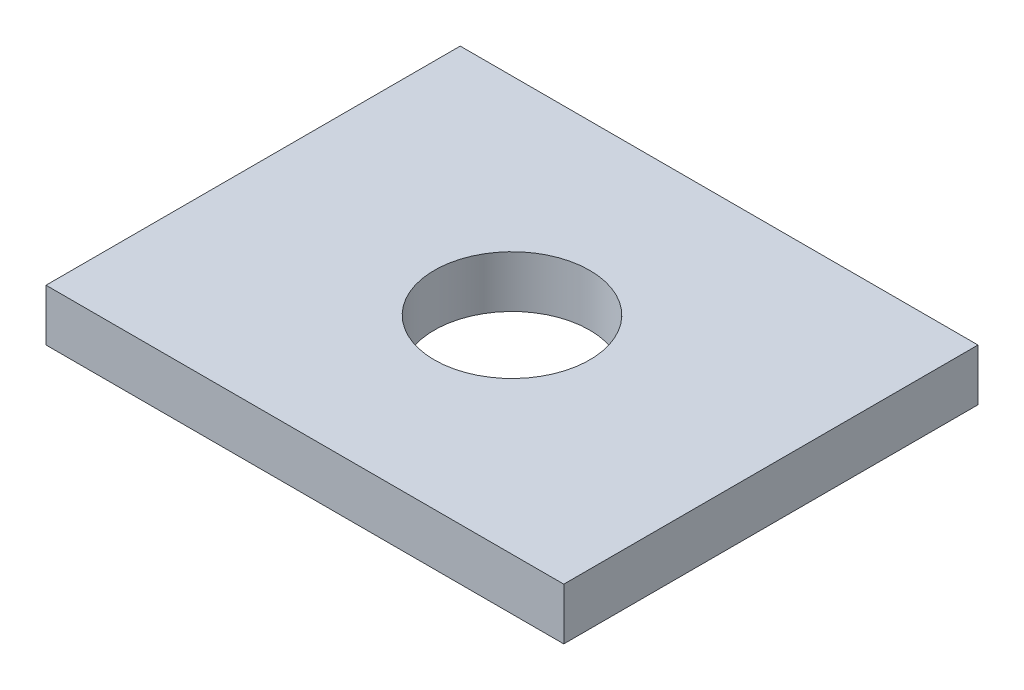
ISO-10303-21;
HEADER;
FILE_DESCRIPTION(('STEP AP214'),'2;1');
FILE_NAME('part.step','',(''),(''),'','','');
FILE_SCHEMA(('AUTOMOTIVE_DESIGN { 1 0 10303 214 1 1 1 1 }'));
ENDSEC;
DATA;
#1=APPLICATION_CONTEXT('core data for automotive mechanical design processes');
#2=APPLICATION_PROTOCOL_DEFINITION('international standard','automotive_design',2000,#1);
#3=PRODUCT_CONTEXT('',#1,'mechanical');
#4=PRODUCT('Part','Part','',(#3));
#5=PRODUCT_RELATED_PRODUCT_CATEGORY('part','',(#4));
#6=PRODUCT_DEFINITION_FORMATION('','',#4);
#7=PRODUCT_DEFINITION_CONTEXT('part definition',#1,'design');
#8=PRODUCT_DEFINITION('design','',#6,#7);
#9=PRODUCT_DEFINITION_SHAPE('','',#8);
#10=(LENGTH_UNIT() NAMED_UNIT(*) SI_UNIT(.MILLI.,.METRE.));
#11=(NAMED_UNIT(*) PLANE_ANGLE_UNIT() SI_UNIT($,.RADIAN.));
#12=(NAMED_UNIT(*) SI_UNIT($,.STERADIAN.) SOLID_ANGLE_UNIT());
#13=UNCERTAINTY_MEASURE_WITH_UNIT(LENGTH_MEASURE(1.E-05),#10,'distance_accuracy_value','');
#14=(GEOMETRIC_REPRESENTATION_CONTEXT(3) GLOBAL_UNCERTAINTY_ASSIGNED_CONTEXT((#13)) GLOBAL_UNIT_ASSIGNED_CONTEXT((#10,
#11,#12)) REPRESENTATION_CONTEXT('',''));
#15=CARTESIAN_POINT('',(0.,0.,0.));
#16=DIRECTION('',(0.,0.,1.));
#17=DIRECTION('',(1.,0.,0.));
#18=AXIS2_PLACEMENT_3D('',#15,#16,#17);
#19=CARTESIAN_POINT('',(100.,20.,-80.));
#20=DIRECTION('',(1.,0.,0.));
#21=DIRECTION('',(0.,0.,-1.));
#22=AXIS2_PLACEMENT_3D('',#19,#20,#21);
#23=PLANE('',#22);
#24=DIRECTION('',(0.,0.,1.));
#25=VECTOR('',#24,1.);
#26=CARTESIAN_POINT('',(100.,0.,-80.));
#27=LINE('',#26,#25);
#28=CARTESIAN_POINT('',(100.,0.,-80.));
#29=VERTEX_POINT('',#28);
#30=CARTESIAN_POINT('',(100.,0.,80.));
#31=VERTEX_POINT('',#30);
#32=EDGE_CURVE('E101',#29,#31,#27,.T.);
#33=ORIENTED_EDGE('',*,*,#32,.F.);
#34=DIRECTION('',(0.,-1.,0.));
#35=VECTOR('',#34,1.);
#36=CARTESIAN_POINT('',(100.,20.,-80.));
#37=LINE('',#36,#35);
#38=CARTESIAN_POINT('',(100.,20.,-80.));
#39=VERTEX_POINT('',#38);
#40=EDGE_CURVE('E11',#39,#29,#37,.T.);
#41=ORIENTED_EDGE('',*,*,#40,.F.);
#42=DIRECTION('',(0.,0.,1.));
#43=VECTOR('',#42,1.);
#44=CARTESIAN_POINT('',(100.,20.,-80.));
#45=LINE('',#44,#43);
#46=CARTESIAN_POINT('',(100.,20.,80.));
#47=VERTEX_POINT('',#46);
#48=EDGE_CURVE('E95',#39,#47,#45,.T.);
#49=ORIENTED_EDGE('',*,*,#48,.T.);
#50=DIRECTION('',(0.,-1.,0.));
#51=VECTOR('',#50,1.);
#52=CARTESIAN_POINT('',(100.,20.,80.));
#53=LINE('',#52,#51);
#54=EDGE_CURVE('E74',#47,#31,#53,.T.);
#55=ORIENTED_EDGE('',*,*,#54,.T.);
#56=EDGE_LOOP('',(#33,#41,#49,#55));
#57=FACE_BOUND('',#56,.T.);
#58=ADVANCED_FACE('F33',(#57),#23,.T.);
#59=CARTESIAN_POINT('',(100.,20.,-80.));
#60=DIRECTION('',(0.,0.,1.));
#61=DIRECTION('',(1.,0.,0.));
#62=AXIS2_PLACEMENT_3D('',#59,#60,#61);
#63=PLANE('',#62);
#64=DIRECTION('',(-1.,0.,0.));
#65=VECTOR('',#64,1.);
#66=CARTESIAN_POINT('',(100.,0.,-80.));
#67=LINE('',#66,#65);
#68=CARTESIAN_POINT('',(-100.,0.,-80.));
#69=VERTEX_POINT('',#68);
#70=EDGE_CURVE('E66',#29,#69,#67,.T.);
#71=ORIENTED_EDGE('',*,*,#70,.T.);
#72=DIRECTION('',(0.,-1.,0.));
#73=VECTOR('',#72,1.);
#74=CARTESIAN_POINT('',(-100.,20.,-80.));
#75=LINE('',#74,#73);
#76=CARTESIAN_POINT('',(-100.,20.,-80.));
#77=VERTEX_POINT('',#76);
#78=EDGE_CURVE('E42',#77,#69,#75,.T.);
#79=ORIENTED_EDGE('',*,*,#78,.F.);
#80=DIRECTION('',(-1.,0.,0.));
#81=VECTOR('',#80,1.);
#82=CARTESIAN_POINT('',(100.,20.,-80.));
#83=LINE('',#82,#81);
#84=EDGE_CURVE('E84',#39,#77,#83,.T.);
#85=ORIENTED_EDGE('',*,*,#84,.F.);
#86=ORIENTED_EDGE('',*,*,#40,.T.);
#87=EDGE_LOOP('',(#71,#79,#85,#86));
#88=FACE_BOUND('',#87,.T.);
#89=ADVANCED_FACE('F125',(#88),#63,.F.);
#90=CARTESIAN_POINT('',(-100.,20.,-80.));
#91=DIRECTION('',(1.,0.,0.));
#92=DIRECTION('',(0.,0.,-1.));
#93=AXIS2_PLACEMENT_3D('',#90,#91,#92);
#94=PLANE('',#93);
#95=DIRECTION('',(0.,0.,1.));
#96=VECTOR('',#95,1.);
#97=CARTESIAN_POINT('',(-100.,0.,-80.));
#98=LINE('',#97,#96);
#99=CARTESIAN_POINT('',(-100.,0.,80.));
#100=VERTEX_POINT('',#99);
#101=EDGE_CURVE('E91',#69,#100,#98,.T.);
#102=ORIENTED_EDGE('',*,*,#101,.T.);
#103=DIRECTION('',(0.,-1.,0.));
#104=VECTOR('',#103,1.);
#105=CARTESIAN_POINT('',(-100.,20.,80.));
#106=LINE('',#105,#104);
#107=CARTESIAN_POINT('',(-100.,20.,80.));
#108=VERTEX_POINT('',#107);
#109=EDGE_CURVE('E88',#108,#100,#106,.T.);
#110=ORIENTED_EDGE('',*,*,#109,.F.);
#111=DIRECTION('',(0.,0.,1.));
#112=VECTOR('',#111,1.);
#113=CARTESIAN_POINT('',(-100.,20.,-80.));
#114=LINE('',#113,#112);
#115=EDGE_CURVE('E79',#77,#108,#114,.T.);
#116=ORIENTED_EDGE('',*,*,#115,.F.);
#117=ORIENTED_EDGE('',*,*,#78,.T.);
#118=EDGE_LOOP('',(#102,#110,#116,#117));
#119=FACE_BOUND('',#118,.T.);
#120=ADVANCED_FACE('F89',(#119),#94,.F.);
#121=CARTESIAN_POINT('',(100.,20.,80.));
#122=DIRECTION('',(0.,0.,1.));
#123=DIRECTION('',(1.,0.,0.));
#124=AXIS2_PLACEMENT_3D('',#121,#122,#123);
#125=PLANE('',#124);
#126=DIRECTION('',(-1.,0.,0.));
#127=VECTOR('',#126,1.);
#128=CARTESIAN_POINT('',(100.,0.,80.));
#129=LINE('',#128,#127);
#130=EDGE_CURVE('E104',#31,#100,#129,.T.);
#131=ORIENTED_EDGE('',*,*,#130,.F.);
#132=ORIENTED_EDGE('',*,*,#54,.F.);
#133=DIRECTION('',(-1.,0.,0.));
#134=VECTOR('',#133,1.);
#135=CARTESIAN_POINT('',(100.,20.,80.));
#136=LINE('',#135,#134);
#137=EDGE_CURVE('E83',#47,#108,#136,.T.);
#138=ORIENTED_EDGE('',*,*,#137,.T.);
#139=ORIENTED_EDGE('',*,*,#109,.T.);
#140=EDGE_LOOP('',(#131,#132,#138,#139));
#141=FACE_BOUND('',#140,.T.);
#142=ADVANCED_FACE('F94',(#141),#125,.T.);
#143=CARTESIAN_POINT('',(0.,20.,0.));
#144=DIRECTION('',(0.,-1.,0.));
#145=DIRECTION('',(0.,0.,-1.));
#146=AXIS2_PLACEMENT_3D('',#143,#144,#145);
#147=PLANE('',#146);
#148=CARTESIAN_POINT('',(0.,20.,0.));
#149=DIRECTION('',(0.,1.,0.));
#150=DIRECTION('',(0.,0.,1.));
#151=AXIS2_PLACEMENT_3D('',#148,#149,#150);
#152=CIRCLE('',#151,30.);
#153=CARTESIAN_POINT('',(0.,20.,30.));
#154=VERTEX_POINT('',#153);
#155=EDGE_CURVE('E171',#154,#154,#152,.T.);
#156=ORIENTED_EDGE('',*,*,#155,.F.);
#157=EDGE_LOOP('',(#156));
#158=FACE_BOUND('',#157,.T.);
#159=ORIENTED_EDGE('',*,*,#48,.F.);
#160=ORIENTED_EDGE('',*,*,#84,.T.);
#161=ORIENTED_EDGE('',*,*,#115,.T.);
#162=ORIENTED_EDGE('',*,*,#137,.F.);
#163=EDGE_LOOP('',(#159,#160,#161,#162));
#164=FACE_BOUND('',#163,.T.);
#165=ADVANCED_FACE('F82',(#158,#164),#147,.F.);
#166=CARTESIAN_POINT('',(0.,0.,0.));
#167=DIRECTION('',(0.,-1.,0.));
#168=DIRECTION('',(0.,0.,-1.));
#169=AXIS2_PLACEMENT_3D('',#166,#167,#168);
#170=PLANE('',#169);
#171=CARTESIAN_POINT('',(0.,0.,0.));
#172=DIRECTION('',(0.,-1.,0.));
#173=DIRECTION('',(0.,0.,-1.));
#174=AXIS2_PLACEMENT_3D('',#171,#172,#173);
#175=CIRCLE('',#174,30.);
#176=CARTESIAN_POINT('',(0.,0.,-30.));
#177=VERTEX_POINT('',#176);
#178=EDGE_CURVE('E36',#177,#177,#175,.T.);
#179=ORIENTED_EDGE('',*,*,#178,.F.);
#180=EDGE_LOOP('',(#179));
#181=FACE_BOUND('',#180,.T.);
#182=ORIENTED_EDGE('',*,*,#32,.T.);
#183=ORIENTED_EDGE('',*,*,#130,.T.);
#184=ORIENTED_EDGE('',*,*,#101,.F.);
#185=ORIENTED_EDGE('',*,*,#70,.F.);
#186=EDGE_LOOP('',(#182,#183,#184,#185));
#187=FACE_BOUND('',#186,.T.);
#188=ADVANCED_FACE('F109',(#181,#187),#170,.T.);
#189=CARTESIAN_POINT('',(0.,-20.,0.));
#190=DIRECTION('',(0.,1.,0.));
#191=DIRECTION('',(0.,0.,1.));
#192=AXIS2_PLACEMENT_3D('',#189,#190,#191);
#193=CYLINDRICAL_SURFACE('',#192,30.);
#194=ORIENTED_EDGE('',*,*,#178,.T.);
#195=EDGE_LOOP('',(#194));
#196=FACE_BOUND('',#195,.T.);
#197=ORIENTED_EDGE('',*,*,#155,.T.);
#198=EDGE_LOOP('',(#197));
#199=FACE_BOUND('',#198,.T.);
#200=ADVANCED_FACE('F111',(#196,#199),#193,.F.);
#201=CLOSED_SHELL('',(#58,#89,#120,#142,#165,#188,#200));
#202=MANIFOLD_SOLID_BREP('B2',#201);
#203=ADVANCED_BREP_SHAPE_REPRESENTATION('',(#18,#202),#14);
#204=SHAPE_DEFINITION_REPRESENTATION(#9,#203);
ENDSEC;
END-ISO-10303-21;
